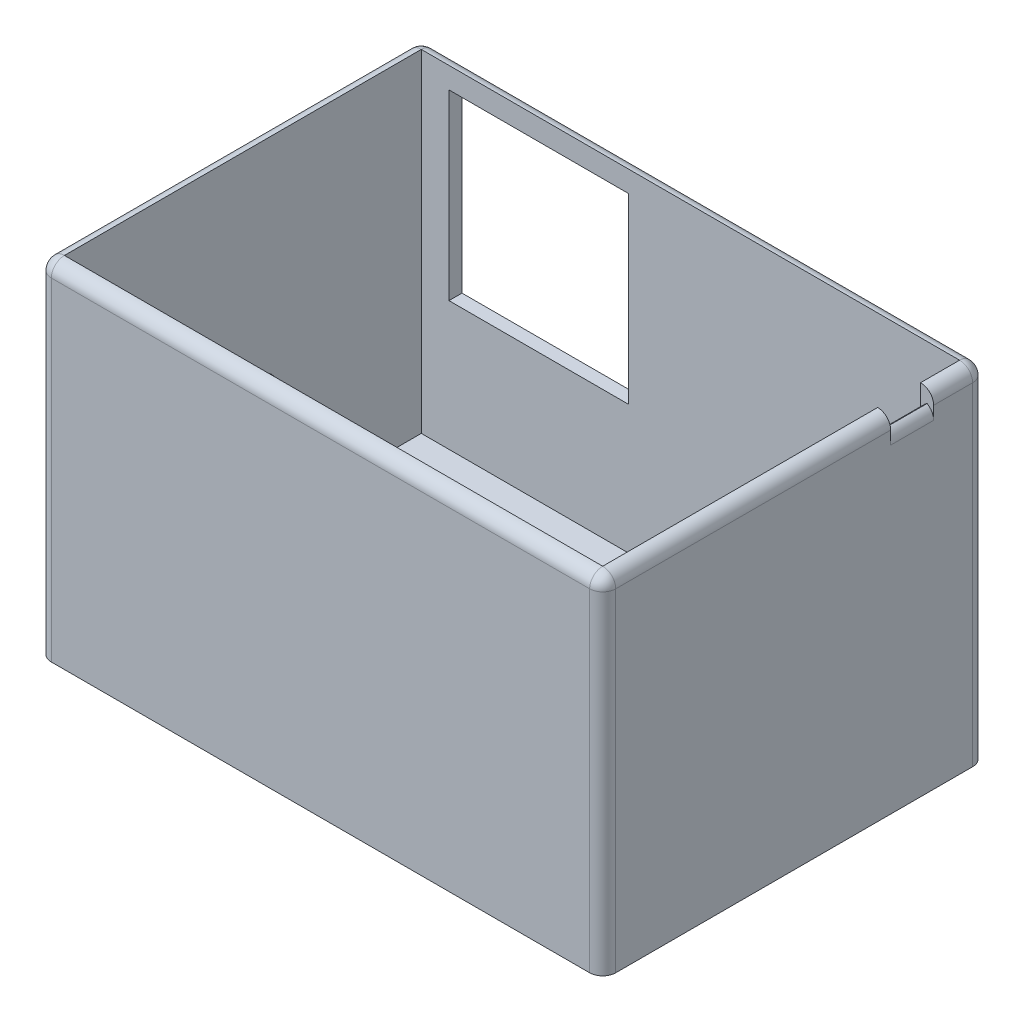
ISO-10303-21;
HEADER;
FILE_DESCRIPTION(('STEP AP214'),'2;1');
FILE_NAME('part.step','',(''),(''),'','','');
FILE_SCHEMA(('AUTOMOTIVE_DESIGN { 1 0 10303 214 1 1 1 1 }'));
ENDSEC;
DATA;
#1=APPLICATION_CONTEXT('core data for automotive mechanical design processes');
#2=APPLICATION_PROTOCOL_DEFINITION('international standard','automotive_design',2000,#1);
#3=PRODUCT_CONTEXT('',#1,'mechanical');
#4=PRODUCT('Part','Part','',(#3));
#5=PRODUCT_RELATED_PRODUCT_CATEGORY('part','',(#4));
#6=PRODUCT_DEFINITION_FORMATION('','',#4);
#7=PRODUCT_DEFINITION_CONTEXT('part definition',#1,'design');
#8=PRODUCT_DEFINITION('design','',#6,#7);
#9=PRODUCT_DEFINITION_SHAPE('','',#8);
#10=(LENGTH_UNIT() NAMED_UNIT(*) SI_UNIT(.MILLI.,.METRE.));
#11=(NAMED_UNIT(*) PLANE_ANGLE_UNIT() SI_UNIT($,.RADIAN.));
#12=(NAMED_UNIT(*) SI_UNIT($,.STERADIAN.) SOLID_ANGLE_UNIT());
#13=UNCERTAINTY_MEASURE_WITH_UNIT(LENGTH_MEASURE(1.E-05),#10,'distance_accuracy_value','');
#14=(GEOMETRIC_REPRESENTATION_CONTEXT(3) GLOBAL_UNCERTAINTY_ASSIGNED_CONTEXT((#13)) GLOBAL_UNIT_ASSIGNED_CONTEXT((#10,
#11,#12)) REPRESENTATION_CONTEXT('',''));
#15=CARTESIAN_POINT('',(0.,0.,0.));
#16=DIRECTION('',(0.,0.,1.));
#17=DIRECTION('',(1.,0.,0.));
#18=AXIS2_PLACEMENT_3D('',#15,#16,#17);
#19=CARTESIAN_POINT('',(41.275,51.,-29.365));
#20=DIRECTION('',(0.,0.,-1.));
#21=DIRECTION('',(-1.,0.,0.));
#22=AXIS2_PLACEMENT_3D('',#19,#20,#21);
#23=CYLINDRICAL_SURFACE('',#22,2.);
#24=CARTESIAN_POINT('',(41.275,51.,-14.7966567752096));
#25=DIRECTION('',(0.,0.,1.));
#26=DIRECTION('',(1.,0.,0.));
#27=AXIS2_PLACEMENT_3D('',#24,#25,#26);
#28=CIRCLE('',#27,2.);
#29=CARTESIAN_POINT('',(41.275,53.,-14.7966567752096));
#30=VERTEX_POINT('',#29);
#31=CARTESIAN_POINT('',(43.275,51.,-14.7966567752096));
#32=VERTEX_POINT('',#31);
#33=EDGE_CURVE('E470',#30,#32,#28,.F.);
#34=ORIENTED_EDGE('',*,*,#33,.F.);
#35=DIRECTION('',(0.,0.,1.));
#36=VECTOR('',#35,1.);
#37=CARTESIAN_POINT('',(41.275,53.,0.));
#38=LINE('',#37,#36);
#39=CARTESIAN_POINT('',(41.275,53.,27.365));
#40=VERTEX_POINT('',#39);
#41=EDGE_CURVE('E301',#30,#40,#38,.T.);
#42=ORIENTED_EDGE('',*,*,#41,.T.);
#43=CARTESIAN_POINT('',(41.275,51.,27.365));
#44=DIRECTION('',(0.,0.,1.));
#45=DIRECTION('',(0.,-1.,0.));
#46=AXIS2_PLACEMENT_3D('',#43,#44,#45);
#47=CIRCLE('',#46,2.);
#48=CARTESIAN_POINT('',(43.275,51.,27.365));
#49=VERTEX_POINT('',#48);
#50=EDGE_CURVE('E457',#49,#40,#47,.T.);
#51=ORIENTED_EDGE('',*,*,#50,.F.);
#52=DIRECTION('',(0.,0.,1.));
#53=VECTOR('',#52,1.);
#54=CARTESIAN_POINT('',(43.275,51.,29.365));
#55=LINE('',#54,#53);
#56=EDGE_CURVE('E394',#32,#49,#55,.T.);
#57=ORIENTED_EDGE('',*,*,#56,.F.);
#58=EDGE_LOOP('',(#34,#42,#51,#57));
#59=FACE_BOUND('',#58,.T.);
#60=ADVANCED_FACE('F46',(#59),#23,.T.);
#61=CARTESIAN_POINT('',(43.275,53.,-29.365));
#62=DIRECTION('',(1.,0.,0.));
#63=DIRECTION('',(0.,0.,-1.));
#64=AXIS2_PLACEMENT_3D('',#61,#62,#63);
#65=PLANE('',#64);
#66=CARTESIAN_POINT('',(43.275,51.,-27.365));
#67=VERTEX_POINT('',#66);
#68=CARTESIAN_POINT('',(43.275,51.,-21.3864446389071));
#69=VERTEX_POINT('',#68);
#70=EDGE_CURVE('E395',#67,#69,#55,.T.);
#71=ORIENTED_EDGE('',*,*,#70,.T.);
#72=DIRECTION('',(0.,-1.,0.));
#73=VECTOR('',#72,1.);
#74=CARTESIAN_POINT('',(43.275,51.,-21.3864446389071));
#75=LINE('',#74,#73);
#76=CARTESIAN_POINT('',(43.275,49.,-21.3864446389071));
#77=VERTEX_POINT('',#76);
#78=EDGE_CURVE('E481',#69,#77,#75,.T.);
#79=ORIENTED_EDGE('',*,*,#78,.T.);
#80=DIRECTION('',(0.,0.,-1.));
#81=VECTOR('',#80,1.);
#82=CARTESIAN_POINT('',(43.275,49.,-14.7966567752096));
#83=LINE('',#82,#81);
#84=CARTESIAN_POINT('',(43.275,49.,-14.7966567752096));
#85=VERTEX_POINT('',#84);
#86=EDGE_CURVE('E477',#77,#85,#83,.F.);
#87=ORIENTED_EDGE('',*,*,#86,.T.);
#88=DIRECTION('',(0.,1.,0.));
#89=VECTOR('',#88,1.);
#90=CARTESIAN_POINT('',(43.275,51.,-14.7966567752096));
#91=LINE('',#90,#89);
#92=EDGE_CURVE('E474',#85,#32,#91,.T.);
#93=ORIENTED_EDGE('',*,*,#92,.T.);
#94=ORIENTED_EDGE('',*,*,#56,.T.);
#95=DIRECTION('',(0.,-1.,0.));
#96=VECTOR('',#95,1.);
#97=CARTESIAN_POINT('',(43.275,53.,27.365));
#98=LINE('',#97,#96);
#99=CARTESIAN_POINT('',(43.275,0.,27.365));
#100=VERTEX_POINT('',#99);
#101=EDGE_CURVE('E399',#49,#100,#98,.T.);
#102=ORIENTED_EDGE('',*,*,#101,.T.);
#103=DIRECTION('',(0.,0.,1.));
#104=VECTOR('',#103,1.);
#105=CARTESIAN_POINT('',(43.275,0.,-29.365));
#106=LINE('',#105,#104);
#107=CARTESIAN_POINT('',(43.275,0.,-27.365));
#108=VERTEX_POINT('',#107);
#109=EDGE_CURVE('E291',#108,#100,#106,.T.);
#110=ORIENTED_EDGE('',*,*,#109,.F.);
#111=DIRECTION('',(0.,-1.,0.));
#112=VECTOR('',#111,1.);
#113=CARTESIAN_POINT('',(43.275,53.,-27.365));
#114=LINE('',#113,#112);
#115=EDGE_CURVE('E391',#108,#67,#114,.F.);
#116=ORIENTED_EDGE('',*,*,#115,.T.);
#117=EDGE_LOOP('',(#71,#79,#87,#93,#94,#102,#110,#116));
#118=FACE_BOUND('',#117,.T.);
#119=ADVANCED_FACE('F589',(#118),#65,.T.);
#120=CARTESIAN_POINT('',(43.275,53.,-29.365));
#121=DIRECTION('',(0.,0.,1.));
#122=DIRECTION('',(1.,0.,0.));
#123=AXIS2_PLACEMENT_3D('',#120,#121,#122);
#124=PLANE('',#123);
#125=DIRECTION('',(-1.,0.,0.));
#126=VECTOR('',#125,1.);
#127=CARTESIAN_POINT('',(-37.0331029560129,21.7540115767749,-29.365));
#128=LINE('',#127,#126);
#129=CARTESIAN_POINT('',(-9.53310295601291,21.7540115767749,-29.365));
#130=VERTEX_POINT('',#129);
#131=CARTESIAN_POINT('',(-37.0331029560129,21.7540115767749,-29.365));
#132=VERTEX_POINT('',#131);
#133=EDGE_CURVE('E250',#130,#132,#128,.T.);
#134=ORIENTED_EDGE('',*,*,#133,.F.);
#135=DIRECTION('',(0.,-1.,0.));
#136=VECTOR('',#135,1.);
#137=CARTESIAN_POINT('',(-9.5331029560129,49.7440115767749,-29.365));
#138=LINE('',#137,#136);
#139=CARTESIAN_POINT('',(-9.5331029560129,49.7440115767749,-29.365));
#140=VERTEX_POINT('',#139);
#141=EDGE_CURVE('E62',#140,#130,#138,.T.);
#142=ORIENTED_EDGE('',*,*,#141,.F.);
#143=DIRECTION('',(1.,0.,0.));
#144=VECTOR('',#143,1.);
#145=CARTESIAN_POINT('',(-37.0331029560129,49.7440115767749,-29.365));
#146=LINE('',#145,#144);
#147=CARTESIAN_POINT('',(-37.0331029560129,49.7440115767749,-29.365));
#148=VERTEX_POINT('',#147);
#149=EDGE_CURVE('E258',#148,#140,#146,.T.);
#150=ORIENTED_EDGE('',*,*,#149,.F.);
#151=DIRECTION('',(0.,1.,0.));
#152=VECTOR('',#151,1.);
#153=CARTESIAN_POINT('',(-37.0331029560129,49.7440115767749,-29.365));
#154=LINE('',#153,#152);
#155=EDGE_CURVE('E240',#132,#148,#154,.T.);
#156=ORIENTED_EDGE('',*,*,#155,.F.);
#157=EDGE_LOOP('',(#134,#142,#150,#156));
#158=FACE_BOUND('',#157,.T.);
#159=DIRECTION('',(-1.,0.,0.));
#160=VECTOR('',#159,1.);
#161=CARTESIAN_POINT('',(43.275,51.,-29.365));
#162=LINE('',#161,#160);
#163=CARTESIAN_POINT('',(-41.275,51.,-29.365));
#164=VERTEX_POINT('',#163);
#165=CARTESIAN_POINT('',(41.275,51.,-29.365));
#166=VERTEX_POINT('',#165);
#167=EDGE_CURVE('E385',#164,#166,#162,.F.);
#168=ORIENTED_EDGE('',*,*,#167,.T.);
#169=DIRECTION('',(0.,-1.,0.));
#170=VECTOR('',#169,1.);
#171=CARTESIAN_POINT('',(41.275,0.,-29.365));
#172=LINE('',#171,#170);
#173=CARTESIAN_POINT('',(41.275,0.,-29.365));
#174=VERTEX_POINT('',#173);
#175=EDGE_CURVE('E388',#166,#174,#172,.T.);
#176=ORIENTED_EDGE('',*,*,#175,.T.);
#177=DIRECTION('',(-1.,0.,0.));
#178=VECTOR('',#177,1.);
#179=CARTESIAN_POINT('',(43.275,0.,-29.365));
#180=LINE('',#179,#178);
#181=CARTESIAN_POINT('',(-41.275,0.,-29.365));
#182=VERTEX_POINT('',#181);
#183=EDGE_CURVE('E339',#174,#182,#180,.T.);
#184=ORIENTED_EDGE('',*,*,#183,.T.);
#185=DIRECTION('',(0.,-1.,0.));
#186=VECTOR('',#185,1.);
#187=CARTESIAN_POINT('',(-41.275,53.,-29.365));
#188=LINE('',#187,#186);
#189=EDGE_CURVE('E382',#182,#164,#188,.F.);
#190=ORIENTED_EDGE('',*,*,#189,.T.);
#191=EDGE_LOOP('',(#168,#176,#184,#190));
#192=FACE_BOUND('',#191,.T.);
#193=ADVANCED_FACE('F255',(#158,#192),#124,.F.);
#194=CARTESIAN_POINT('',(-43.275,53.,-29.365));
#195=DIRECTION('',(1.,0.,0.));
#196=DIRECTION('',(0.,0.,-1.));
#197=AXIS2_PLACEMENT_3D('',#194,#195,#196);
#198=PLANE('',#197);
#199=CARTESIAN_POINT('',(-43.275,13.8979250719779,3.00000000000001));
#200=DIRECTION('',(1.,0.,0.));
#201=DIRECTION('',(0.,0.,-1.));
#202=AXIS2_PLACEMENT_3D('',#199,#200,#201);
#203=CIRCLE('',#202,4.);
#204=CARTESIAN_POINT('',(-43.275,13.8979250719779,7.00000000000001));
#205=VERTEX_POINT('',#204);
#206=CARTESIAN_POINT('',(-43.275,9.89792507197792,3.00000000000001));
#207=VERTEX_POINT('',#206);
#208=EDGE_CURVE('E525',#205,#207,#203,.T.);
#209=ORIENTED_EDGE('',*,*,#208,.T.);
#210=DIRECTION('',(0.,0.,1.));
#211=VECTOR('',#210,1.);
#212=CARTESIAN_POINT('',(-43.275,9.89792507197791,-29.365));
#213=LINE('',#212,#211);
#214=CARTESIAN_POINT('',(-43.275,9.89792507197792,-2.99999999999999));
#215=VERTEX_POINT('',#214);
#216=EDGE_CURVE('E528',#207,#215,#213,.F.);
#217=ORIENTED_EDGE('',*,*,#216,.T.);
#218=CARTESIAN_POINT('',(-43.275,13.8979250719779,-2.99999999999999));
#219=DIRECTION('',(1.,0.,0.));
#220=DIRECTION('',(0.,0.,-1.));
#221=AXIS2_PLACEMENT_3D('',#218,#219,#220);
#222=CIRCLE('',#221,4.);
#223=CARTESIAN_POINT('',(-43.275,13.8979250719779,-6.99999999999999));
#224=VERTEX_POINT('',#223);
#225=EDGE_CURVE('E522',#215,#224,#222,.T.);
#226=ORIENTED_EDGE('',*,*,#225,.T.);
#227=DIRECTION('',(0.,-1.,0.));
#228=VECTOR('',#227,1.);
#229=CARTESIAN_POINT('',(-43.275,53.,-7.));
#230=LINE('',#229,#228);
#231=CARTESIAN_POINT('',(-43.275,19.8979250719779,-6.99999999999999));
#232=VERTEX_POINT('',#231);
#233=EDGE_CURVE('E516',#224,#232,#230,.F.);
#234=ORIENTED_EDGE('',*,*,#233,.T.);
#235=CARTESIAN_POINT('',(-43.275,19.8979250719779,-2.99999999999999));
#236=DIRECTION('',(1.,0.,0.));
#237=DIRECTION('',(0.,0.,-1.));
#238=AXIS2_PLACEMENT_3D('',#235,#236,#237);
#239=CIRCLE('',#238,4.);
#240=CARTESIAN_POINT('',(-43.275,23.8979250719779,-2.99999999999999));
#241=VERTEX_POINT('',#240);
#242=EDGE_CURVE('E509',#232,#241,#239,.T.);
#243=ORIENTED_EDGE('',*,*,#242,.T.);
#244=DIRECTION('',(0.,0.,-1.));
#245=VECTOR('',#244,1.);
#246=CARTESIAN_POINT('',(-43.275,23.8979250719779,-29.365));
#247=LINE('',#246,#245);
#248=CARTESIAN_POINT('',(-43.275,23.8979250719779,3.00000000000001));
#249=VERTEX_POINT('',#248);
#250=EDGE_CURVE('E502',#241,#249,#247,.F.);
#251=ORIENTED_EDGE('',*,*,#250,.T.);
#252=CARTESIAN_POINT('',(-43.275,19.8979250719779,3.00000000000001));
#253=DIRECTION('',(1.,0.,0.));
#254=DIRECTION('',(0.,0.,-1.));
#255=AXIS2_PLACEMENT_3D('',#252,#253,#254);
#256=CIRCLE('',#255,4.);
#257=CARTESIAN_POINT('',(-43.275,19.8979250719779,7.00000000000001));
#258=VERTEX_POINT('',#257);
#259=EDGE_CURVE('E512',#249,#258,#256,.T.);
#260=ORIENTED_EDGE('',*,*,#259,.T.);
#261=DIRECTION('',(0.,1.,0.));
#262=VECTOR('',#261,1.);
#263=CARTESIAN_POINT('',(-43.275,53.,7.00000000000001));
#264=LINE('',#263,#262);
#265=EDGE_CURVE('E519',#258,#205,#264,.F.);
#266=ORIENTED_EDGE('',*,*,#265,.T.);
#267=EDGE_LOOP('',(#209,#217,#226,#234,#243,#251,#260,#266));
#268=FACE_BOUND('',#267,.T.);
#269=DIRECTION('',(0.,0.,1.));
#270=VECTOR('',#269,1.);
#271=CARTESIAN_POINT('',(-43.275,0.,-29.365));
#272=LINE('',#271,#270);
#273=CARTESIAN_POINT('',(-43.275,0.,-27.365));
#274=VERTEX_POINT('',#273);
#275=CARTESIAN_POINT('',(-43.275,0.,27.365));
#276=VERTEX_POINT('',#275);
#277=EDGE_CURVE('E335',#274,#276,#272,.T.);
#278=ORIENTED_EDGE('',*,*,#277,.T.);
#279=DIRECTION('',(0.,-1.,0.));
#280=VECTOR('',#279,1.);
#281=CARTESIAN_POINT('',(-43.275,53.,27.365));
#282=LINE('',#281,#280);
#283=CARTESIAN_POINT('',(-43.275,51.,27.365));
#284=VERTEX_POINT('',#283);
#285=EDGE_CURVE('E379',#276,#284,#282,.F.);
#286=ORIENTED_EDGE('',*,*,#285,.T.);
#287=DIRECTION('',(0.,0.,1.));
#288=VECTOR('',#287,1.);
#289=CARTESIAN_POINT('',(-43.275,51.,-29.365));
#290=LINE('',#289,#288);
#291=CARTESIAN_POINT('',(-43.275,51.,-27.365));
#292=VERTEX_POINT('',#291);
#293=EDGE_CURVE('E375',#284,#292,#290,.F.);
#294=ORIENTED_EDGE('',*,*,#293,.T.);
#295=DIRECTION('',(0.,-1.,0.));
#296=VECTOR('',#295,1.);
#297=CARTESIAN_POINT('',(-43.275,53.,-27.365));
#298=LINE('',#297,#296);
#299=EDGE_CURVE('E372',#292,#274,#298,.T.);
#300=ORIENTED_EDGE('',*,*,#299,.T.);
#301=EDGE_LOOP('',(#278,#286,#294,#300));
#302=FACE_BOUND('',#301,.T.);
#303=ADVANCED_FACE('F668',(#268,#302),#198,.F.);
#304=CARTESIAN_POINT('',(43.275,53.,29.365));
#305=DIRECTION('',(0.,0.,1.));
#306=DIRECTION('',(1.,0.,0.));
#307=AXIS2_PLACEMENT_3D('',#304,#305,#306);
#308=PLANE('',#307);
#309=DIRECTION('',(-1.,0.,0.));
#310=VECTOR('',#309,1.);
#311=CARTESIAN_POINT('',(43.275,0.,29.365));
#312=LINE('',#311,#310);
#313=CARTESIAN_POINT('',(41.275,0.,29.365));
#314=VERTEX_POINT('',#313);
#315=CARTESIAN_POINT('',(-41.275,0.,29.365));
#316=VERTEX_POINT('',#315);
#317=EDGE_CURVE('E331',#314,#316,#312,.T.);
#318=ORIENTED_EDGE('',*,*,#317,.F.);
#319=DIRECTION('',(0.,-1.,0.));
#320=VECTOR('',#319,1.);
#321=CARTESIAN_POINT('',(41.275,53.,29.365));
#322=LINE('',#321,#320);
#323=CARTESIAN_POINT('',(41.275,51.,29.365));
#324=VERTEX_POINT('',#323);
#325=EDGE_CURVE('E408',#314,#324,#322,.F.);
#326=ORIENTED_EDGE('',*,*,#325,.T.);
#327=DIRECTION('',(-1.,0.,0.));
#328=VECTOR('',#327,1.);
#329=CARTESIAN_POINT('',(-43.275,51.,29.365));
#330=LINE('',#329,#328);
#331=CARTESIAN_POINT('',(-41.275,51.,29.365));
#332=VERTEX_POINT('',#331);
#333=EDGE_CURVE('E405',#324,#332,#330,.T.);
#334=ORIENTED_EDGE('',*,*,#333,.T.);
#335=DIRECTION('',(0.,-1.,0.));
#336=VECTOR('',#335,1.);
#337=CARTESIAN_POINT('',(-41.275,0.,29.365));
#338=LINE('',#337,#336);
#339=EDGE_CURVE('E402',#332,#316,#338,.T.);
#340=ORIENTED_EDGE('',*,*,#339,.T.);
#341=EDGE_LOOP('',(#318,#326,#334,#340));
#342=FACE_BOUND('',#341,.T.);
#343=ADVANCED_FACE('F656',(#342),#308,.T.);
#344=CARTESIAN_POINT('',(0.,0.,0.));
#345=DIRECTION('',(0.,-1.,0.));
#346=DIRECTION('',(0.,0.,-1.));
#347=AXIS2_PLACEMENT_3D('',#344,#345,#346);
#348=PLANE('',#347);
#349=ORIENTED_EDGE('',*,*,#109,.T.);
#350=CARTESIAN_POINT('',(41.275,0.,27.365));
#351=DIRECTION('',(0.,-1.,0.));
#352=DIRECTION('',(0.,0.,-1.));
#353=AXIS2_PLACEMENT_3D('',#350,#351,#352);
#354=CIRCLE('',#353,2.);
#355=EDGE_CURVE('E420',#100,#314,#354,.T.);
#356=ORIENTED_EDGE('',*,*,#355,.T.);
#357=ORIENTED_EDGE('',*,*,#317,.T.);
#358=CARTESIAN_POINT('',(-41.275,0.,27.365));
#359=DIRECTION('',(0.,-1.,0.));
#360=DIRECTION('',(0.,0.,-1.));
#361=AXIS2_PLACEMENT_3D('',#358,#359,#360);
#362=CIRCLE('',#361,2.);
#363=EDGE_CURVE('E414',#316,#276,#362,.T.);
#364=ORIENTED_EDGE('',*,*,#363,.T.);
#365=ORIENTED_EDGE('',*,*,#277,.F.);
#366=CARTESIAN_POINT('',(-41.275,0.,-27.365));
#367=DIRECTION('',(0.,-1.,0.));
#368=DIRECTION('',(0.,0.,-1.));
#369=AXIS2_PLACEMENT_3D('',#366,#367,#368);
#370=CIRCLE('',#369,2.);
#371=EDGE_CURVE('E411',#274,#182,#370,.T.);
#372=ORIENTED_EDGE('',*,*,#371,.T.);
#373=ORIENTED_EDGE('',*,*,#183,.F.);
#374=CARTESIAN_POINT('',(41.275,0.,-27.365));
#375=DIRECTION('',(0.,-1.,0.));
#376=DIRECTION('',(0.,0.,-1.));
#377=AXIS2_PLACEMENT_3D('',#374,#375,#376);
#378=CIRCLE('',#377,2.);
#379=EDGE_CURVE('E417',#174,#108,#378,.T.);
#380=ORIENTED_EDGE('',*,*,#379,.T.);
#381=EDGE_LOOP('',(#349,#356,#357,#364,#365,#372,#373,#380));
#382=FACE_BOUND('',#381,.T.);
#383=ADVANCED_FACE('F665',(#382),#348,.T.);
#384=CARTESIAN_POINT('',(41.275,53.,-29.365));
#385=DIRECTION('',(1.,0.,0.));
#386=DIRECTION('',(0.,0.,-1.));
#387=AXIS2_PLACEMENT_3D('',#384,#385,#386);
#388=PLANE('',#387);
#389=DIRECTION('',(0.,0.,-1.));
#390=VECTOR('',#389,1.);
#391=CARTESIAN_POINT('',(41.275,49.,-29.365));
#392=LINE('',#391,#390);
#393=CARTESIAN_POINT('',(41.275,49.,-14.7966567752096));
#394=VERTEX_POINT('',#393);
#395=CARTESIAN_POINT('',(41.275,49.,-21.3864446389071));
#396=VERTEX_POINT('',#395);
#397=EDGE_CURVE('E485',#394,#396,#392,.T.);
#398=ORIENTED_EDGE('',*,*,#397,.T.);
#399=DIRECTION('',(0.,1.,0.));
#400=VECTOR('',#399,1.);
#401=CARTESIAN_POINT('',(41.275,53.,-21.3864446389071));
#402=LINE('',#401,#400);
#403=CARTESIAN_POINT('',(41.275,53.,-21.3864446389071));
#404=VERTEX_POINT('',#403);
#405=EDGE_CURVE('E273',#396,#404,#402,.T.);
#406=ORIENTED_EDGE('',*,*,#405,.T.);
#407=CARTESIAN_POINT('',(41.275,53.,-27.365));
#408=VERTEX_POINT('',#407);
#409=EDGE_CURVE('E314',#408,#404,#38,.T.);
#410=ORIENTED_EDGE('',*,*,#409,.F.);
#411=DIRECTION('',(0.,-1.,0.));
#412=VECTOR('',#411,1.);
#413=CARTESIAN_POINT('',(41.275,53.,-27.365));
#414=LINE('',#413,#412);
#415=CARTESIAN_POINT('',(41.275,2.,-27.365));
#416=VERTEX_POINT('',#415);
#417=EDGE_CURVE('E288',#408,#416,#414,.T.);
#418=ORIENTED_EDGE('',*,*,#417,.T.);
#419=DIRECTION('',(0.,0.,1.));
#420=VECTOR('',#419,1.);
#421=CARTESIAN_POINT('',(41.275,2.,0.));
#422=LINE('',#421,#420);
#423=CARTESIAN_POINT('',(41.275,2.,27.365));
#424=VERTEX_POINT('',#423);
#425=EDGE_CURVE('E282',#416,#424,#422,.T.);
#426=ORIENTED_EDGE('',*,*,#425,.T.);
#427=DIRECTION('',(0.,-1.,0.));
#428=VECTOR('',#427,1.);
#429=CARTESIAN_POINT('',(41.275,53.,27.365));
#430=LINE('',#429,#428);
#431=EDGE_CURVE('E293',#40,#424,#430,.T.);
#432=ORIENTED_EDGE('',*,*,#431,.F.);
#433=ORIENTED_EDGE('',*,*,#41,.F.);
#434=DIRECTION('',(0.,-1.,0.));
#435=VECTOR('',#434,1.);
#436=CARTESIAN_POINT('',(41.275,53.,-14.7966567752096));
#437=LINE('',#436,#435);
#438=EDGE_CURVE('E277',#30,#394,#437,.T.);
#439=ORIENTED_EDGE('',*,*,#438,.T.);
#440=EDGE_LOOP('',(#398,#406,#410,#418,#426,#432,#433,#439));
#441=FACE_BOUND('',#440,.T.);
#442=ADVANCED_FACE('F622',(#441),#388,.F.);
#443=CARTESIAN_POINT('',(43.275,53.,-27.365));
#444=DIRECTION('',(0.,0.,1.));
#445=DIRECTION('',(1.,0.,0.));
#446=AXIS2_PLACEMENT_3D('',#443,#444,#445);
#447=PLANE('',#446);
#448=DIRECTION('',(0.,1.,0.));
#449=VECTOR('',#448,1.);
#450=CARTESIAN_POINT('',(-9.5331029560129,53.,-27.365));
#451=LINE('',#450,#449);
#452=CARTESIAN_POINT('',(-9.5331029560129,21.7540115767749,-27.365));
#453=VERTEX_POINT('',#452);
#454=CARTESIAN_POINT('',(-9.5331029560129,49.7440115767749,-27.365));
#455=VERTEX_POINT('',#454);
#456=EDGE_CURVE('E11',#453,#455,#451,.T.);
#457=ORIENTED_EDGE('',*,*,#456,.F.);
#458=DIRECTION('',(1.,0.,0.));
#459=VECTOR('',#458,1.);
#460=CARTESIAN_POINT('',(43.275,21.7540115767748,-27.365));
#461=LINE('',#460,#459);
#462=CARTESIAN_POINT('',(-37.0331029560129,21.7540115767749,-27.365));
#463=VERTEX_POINT('',#462);
#464=EDGE_CURVE('E531',#463,#453,#461,.T.);
#465=ORIENTED_EDGE('',*,*,#464,.F.);
#466=DIRECTION('',(0.,-1.,0.));
#467=VECTOR('',#466,1.);
#468=CARTESIAN_POINT('',(-37.0331029560129,53.0000000000001,-27.365));
#469=LINE('',#468,#467);
#470=CARTESIAN_POINT('',(-37.0331029560129,49.7440115767749,-27.365));
#471=VERTEX_POINT('',#470);
#472=EDGE_CURVE('E243',#471,#463,#469,.T.);
#473=ORIENTED_EDGE('',*,*,#472,.F.);
#474=DIRECTION('',(-1.,0.,0.));
#475=VECTOR('',#474,1.);
#476=CARTESIAN_POINT('',(43.275,49.7440115767749,-27.365));
#477=LINE('',#476,#475);
#478=EDGE_CURVE('E55',#455,#471,#477,.T.);
#479=ORIENTED_EDGE('',*,*,#478,.F.);
#480=EDGE_LOOP('',(#457,#465,#473,#479));
#481=FACE_BOUND('',#480,.T.);
#482=DIRECTION('',(-1.,0.,0.));
#483=VECTOR('',#482,1.);
#484=CARTESIAN_POINT('',(0.,2.,-27.365));
#485=LINE('',#484,#483);
#486=CARTESIAN_POINT('',(-41.275,2.,-27.365));
#487=VERTEX_POINT('',#486);
#488=EDGE_CURVE('E298',#416,#487,#485,.T.);
#489=ORIENTED_EDGE('',*,*,#488,.F.);
#490=ORIENTED_EDGE('',*,*,#417,.F.);
#491=DIRECTION('',(-1.,0.,0.));
#492=VECTOR('',#491,1.);
#493=CARTESIAN_POINT('',(0.,53.,-27.365));
#494=LINE('',#493,#492);
#495=CARTESIAN_POINT('',(-41.275,53.,-27.365));
#496=VERTEX_POINT('',#495);
#497=EDGE_CURVE('E297',#408,#496,#494,.T.);
#498=ORIENTED_EDGE('',*,*,#497,.T.);
#499=DIRECTION('',(0.,-1.,0.));
#500=VECTOR('',#499,1.);
#501=CARTESIAN_POINT('',(-41.275,53.,-27.365));
#502=LINE('',#501,#500);
#503=EDGE_CURVE('E292',#496,#487,#502,.T.);
#504=ORIENTED_EDGE('',*,*,#503,.T.);
#505=EDGE_LOOP('',(#489,#490,#498,#504));
#506=FACE_BOUND('',#505,.T.);
#507=ADVANCED_FACE('F570',(#481,#506),#447,.T.);
#508=CARTESIAN_POINT('',(-41.275,53.,-29.365));
#509=DIRECTION('',(1.,0.,0.));
#510=DIRECTION('',(0.,0.,-1.));
#511=AXIS2_PLACEMENT_3D('',#508,#509,#510);
#512=PLANE('',#511);
#513=DIRECTION('',(0.,1.,0.));
#514=VECTOR('',#513,1.);
#515=CARTESIAN_POINT('',(-41.275,53.,-4.99999999999999));
#516=LINE('',#515,#514);
#517=CARTESIAN_POINT('',(-41.275,13.8979250719779,-4.99999999999999));
#518=VERTEX_POINT('',#517);
#519=CARTESIAN_POINT('',(-41.275,19.8979250719779,-4.99999999999999));
#520=VERTEX_POINT('',#519);
#521=EDGE_CURVE('E355',#518,#520,#516,.T.);
#522=ORIENTED_EDGE('',*,*,#521,.F.);
#523=CARTESIAN_POINT('',(-41.275,13.8979250719779,-2.99999999999999));
#524=DIRECTION('',(1.,0.,0.));
#525=DIRECTION('',(0.,0.,-1.));
#526=AXIS2_PLACEMENT_3D('',#523,#524,#525);
#527=CIRCLE('',#526,2.);
#528=CARTESIAN_POINT('',(-41.275,11.8979250719779,-2.99999999999999));
#529=VERTEX_POINT('',#528);
#530=EDGE_CURVE('E362',#518,#529,#527,.F.);
#531=ORIENTED_EDGE('',*,*,#530,.T.);
#532=DIRECTION('',(0.,0.,-1.));
#533=VECTOR('',#532,1.);
#534=CARTESIAN_POINT('',(-41.275,11.8979250719779,-29.365));
#535=LINE('',#534,#533);
#536=CARTESIAN_POINT('',(-41.275,11.8979250719779,3.00000000000001));
#537=VERTEX_POINT('',#536);
#538=EDGE_CURVE('E343',#537,#529,#535,.T.);
#539=ORIENTED_EDGE('',*,*,#538,.F.);
#540=CARTESIAN_POINT('',(-41.275,13.8979250719779,3.00000000000001));
#541=DIRECTION('',(1.,0.,0.));
#542=DIRECTION('',(0.,0.,-1.));
#543=AXIS2_PLACEMENT_3D('',#540,#541,#542);
#544=CIRCLE('',#543,2.);
#545=CARTESIAN_POINT('',(-41.275,13.8979250719779,5.00000000000001));
#546=VERTEX_POINT('',#545);
#547=EDGE_CURVE('E359',#537,#546,#544,.F.);
#548=ORIENTED_EDGE('',*,*,#547,.T.);
#549=DIRECTION('',(0.,-1.,0.));
#550=VECTOR('',#549,1.);
#551=CARTESIAN_POINT('',(-41.275,53.,5.00000000000001));
#552=LINE('',#551,#550);
#553=CARTESIAN_POINT('',(-41.275,19.8979250719779,5.00000000000001));
#554=VERTEX_POINT('',#553);
#555=EDGE_CURVE('E347',#554,#546,#552,.T.);
#556=ORIENTED_EDGE('',*,*,#555,.F.);
#557=CARTESIAN_POINT('',(-41.275,19.8979250719779,3.00000000000001));
#558=DIRECTION('',(1.,0.,0.));
#559=DIRECTION('',(0.,0.,-1.));
#560=AXIS2_PLACEMENT_3D('',#557,#558,#559);
#561=CIRCLE('',#560,2.);
#562=CARTESIAN_POINT('',(-41.275,21.8979250719779,3.00000000000001));
#563=VERTEX_POINT('',#562);
#564=EDGE_CURVE('E365',#554,#563,#561,.F.);
#565=ORIENTED_EDGE('',*,*,#564,.T.);
#566=DIRECTION('',(0.,0.,1.));
#567=VECTOR('',#566,1.);
#568=CARTESIAN_POINT('',(-41.275,21.8979250719779,-29.365));
#569=LINE('',#568,#567);
#570=CARTESIAN_POINT('',(-41.275,21.8979250719779,-3.));
#571=VERTEX_POINT('',#570);
#572=EDGE_CURVE('E351',#571,#563,#569,.T.);
#573=ORIENTED_EDGE('',*,*,#572,.F.);
#574=CARTESIAN_POINT('',(-41.275,19.8979250719779,-2.99999999999999));
#575=DIRECTION('',(1.,0.,0.));
#576=DIRECTION('',(0.,0.,-1.));
#577=AXIS2_PLACEMENT_3D('',#574,#575,#576);
#578=CIRCLE('',#577,2.);
#579=EDGE_CURVE('E369',#571,#520,#578,.F.);
#580=ORIENTED_EDGE('',*,*,#579,.T.);
#581=EDGE_LOOP('',(#522,#531,#539,#548,#556,#565,#573,#580));
#582=FACE_BOUND('',#581,.T.);
#583=DIRECTION('',(0.,0.,1.));
#584=VECTOR('',#583,1.);
#585=CARTESIAN_POINT('',(-41.275,2.,0.));
#586=LINE('',#585,#584);
#587=CARTESIAN_POINT('',(-41.275,2.,27.365));
#588=VERTEX_POINT('',#587);
#589=EDGE_CURVE('E302',#487,#588,#586,.T.);
#590=ORIENTED_EDGE('',*,*,#589,.F.);
#591=ORIENTED_EDGE('',*,*,#503,.F.);
#592=DIRECTION('',(0.,0.,1.));
#593=VECTOR('',#592,1.);
#594=CARTESIAN_POINT('',(-41.275,53.,0.));
#595=LINE('',#594,#593);
#596=CARTESIAN_POINT('',(-41.275,53.,27.365));
#597=VERTEX_POINT('',#596);
#598=EDGE_CURVE('E321',#496,#597,#595,.T.);
#599=ORIENTED_EDGE('',*,*,#598,.T.);
#600=DIRECTION('',(0.,-1.,0.));
#601=VECTOR('',#600,1.);
#602=CARTESIAN_POINT('',(-41.275,53.,27.365));
#603=LINE('',#602,#601);
#604=EDGE_CURVE('E296',#597,#588,#603,.T.);
#605=ORIENTED_EDGE('',*,*,#604,.T.);
#606=EDGE_LOOP('',(#590,#591,#599,#605));
#607=FACE_BOUND('',#606,.T.);
#608=ADVANCED_FACE('F690',(#582,#607),#512,.T.);
#609=CARTESIAN_POINT('',(43.275,53.,27.365));
#610=DIRECTION('',(0.,0.,1.));
#611=DIRECTION('',(1.,0.,0.));
#612=AXIS2_PLACEMENT_3D('',#609,#610,#611);
#613=PLANE('',#612);
#614=DIRECTION('',(-1.,0.,0.));
#615=VECTOR('',#614,1.);
#616=CARTESIAN_POINT('',(0.,2.,27.365));
#617=LINE('',#616,#615);
#618=EDGE_CURVE('E286',#424,#588,#617,.T.);
#619=ORIENTED_EDGE('',*,*,#618,.T.);
#620=ORIENTED_EDGE('',*,*,#604,.F.);
#621=DIRECTION('',(-1.,0.,0.));
#622=VECTOR('',#621,1.);
#623=CARTESIAN_POINT('',(0.,53.,27.365));
#624=LINE('',#623,#622);
#625=EDGE_CURVE('E318',#40,#597,#624,.T.);
#626=ORIENTED_EDGE('',*,*,#625,.F.);
#627=ORIENTED_EDGE('',*,*,#431,.T.);
#628=EDGE_LOOP('',(#619,#620,#626,#627));
#629=FACE_BOUND('',#628,.T.);
#630=ADVANCED_FACE('F697',(#629),#613,.F.);
#631=CARTESIAN_POINT('',(0.,2.,0.));
#632=DIRECTION('',(0.,-1.,0.));
#633=DIRECTION('',(0.,0.,-1.));
#634=AXIS2_PLACEMENT_3D('',#631,#632,#633);
#635=PLANE('',#634);
#636=ORIENTED_EDGE('',*,*,#425,.F.);
#637=ORIENTED_EDGE('',*,*,#488,.T.);
#638=ORIENTED_EDGE('',*,*,#589,.T.);
#639=ORIENTED_EDGE('',*,*,#618,.F.);
#640=EDGE_LOOP('',(#636,#637,#638,#639));
#641=FACE_BOUND('',#640,.T.);
#642=ADVANCED_FACE('F612',(#641),#635,.F.);
#643=CARTESIAN_POINT('',(41.275,53.,-27.365));
#644=DIRECTION('',(0.,1.,0.));
#645=DIRECTION('',(0.,0.,1.));
#646=AXIS2_PLACEMENT_3D('',#643,#644,#645);
#647=CYLINDRICAL_SURFACE('',#646,2.);
#648=ORIENTED_EDGE('',*,*,#379,.F.);
#649=ORIENTED_EDGE('',*,*,#175,.F.);
#650=CARTESIAN_POINT('',(41.275,51.,-27.365));
#651=DIRECTION('',(0.,1.,0.));
#652=DIRECTION('',(0.,0.,1.));
#653=AXIS2_PLACEMENT_3D('',#650,#651,#652);
#654=CIRCLE('',#653,2.);
#655=EDGE_CURVE('E287',#67,#166,#654,.T.);
#656=ORIENTED_EDGE('',*,*,#655,.F.);
#657=ORIENTED_EDGE('',*,*,#115,.F.);
#658=EDGE_LOOP('',(#648,#649,#656,#657));
#659=FACE_BOUND('',#658,.T.);
#660=ADVANCED_FACE('F604',(#659),#647,.T.);
#661=CARTESIAN_POINT('',(41.275,51.,-21.3864446389071));
#662=DIRECTION('',(0.,0.,-1.));
#663=DIRECTION('',(-1.,0.,0.));
#664=AXIS2_PLACEMENT_3D('',#661,#662,#663);
#665=CIRCLE('',#664,2.);
#666=EDGE_CURVE('E423',#69,#404,#665,.F.);
#667=ORIENTED_EDGE('',*,*,#666,.F.);
#668=ORIENTED_EDGE('',*,*,#70,.F.);
#669=CARTESIAN_POINT('',(41.275,51.,-27.365));
#670=DIRECTION('',(0.,0.,-1.));
#671=DIRECTION('',(-1.,0.,0.));
#672=AXIS2_PLACEMENT_3D('',#669,#670,#671);
#673=CIRCLE('',#672,2.);
#674=EDGE_CURVE('E461',#408,#67,#673,.T.);
#675=ORIENTED_EDGE('',*,*,#674,.F.);
#676=ORIENTED_EDGE('',*,*,#409,.T.);
#677=EDGE_LOOP('',(#667,#668,#675,#676));
#678=FACE_BOUND('',#677,.T.);
#679=ADVANCED_FACE('F592',(#678),#23,.T.);
#680=CARTESIAN_POINT('',(41.275,53.,27.365));
#681=DIRECTION('',(0.,-1.,0.));
#682=DIRECTION('',(0.,0.,-1.));
#683=AXIS2_PLACEMENT_3D('',#680,#681,#682);
#684=CYLINDRICAL_SURFACE('',#683,2.);
#685=ORIENTED_EDGE('',*,*,#355,.F.);
#686=ORIENTED_EDGE('',*,*,#101,.F.);
#687=CARTESIAN_POINT('',(41.275,51.,27.365));
#688=DIRECTION('',(0.,1.,0.));
#689=DIRECTION('',(0.,0.,1.));
#690=AXIS2_PLACEMENT_3D('',#687,#688,#689);
#691=CIRCLE('',#690,2.);
#692=EDGE_CURVE('E453',#324,#49,#691,.T.);
#693=ORIENTED_EDGE('',*,*,#692,.F.);
#694=ORIENTED_EDGE('',*,*,#325,.F.);
#695=EDGE_LOOP('',(#685,#686,#693,#694));
#696=FACE_BOUND('',#695,.T.);
#697=ADVANCED_FACE('F603',(#696),#684,.T.);
#698=CARTESIAN_POINT('',(41.275,51.,-27.365));
#699=DIRECTION('',(1.,0.,0.));
#700=DIRECTION('',(0.,0.,-1.));
#701=AXIS2_PLACEMENT_3D('',#698,#699,#700);
#702=SPHERICAL_SURFACE('',#701,2.);
#703=ORIENTED_EDGE('',*,*,#674,.T.);
#704=ORIENTED_EDGE('',*,*,#655,.T.);
#705=CARTESIAN_POINT('',(41.275,51.,-27.365));
#706=DIRECTION('',(1.,0.,0.));
#707=DIRECTION('',(0.,0.,-1.));
#708=AXIS2_PLACEMENT_3D('',#705,#706,#707);
#709=CIRCLE('',#708,2.);
#710=EDGE_CURVE('E449',#408,#166,#709,.F.);
#711=ORIENTED_EDGE('',*,*,#710,.F.);
#712=EDGE_LOOP('',(#703,#704,#711));
#713=FACE_BOUND('',#712,.T.);
#714=ADVANCED_FACE('F609',(#713),#702,.T.);
#715=CARTESIAN_POINT('',(41.275,51.,27.365));
#716=DIRECTION('',(1.,0.,0.));
#717=DIRECTION('',(0.,0.,-1.));
#718=AXIS2_PLACEMENT_3D('',#715,#716,#717);
#719=SPHERICAL_SURFACE('',#718,2.);
#720=ORIENTED_EDGE('',*,*,#692,.T.);
#721=ORIENTED_EDGE('',*,*,#50,.T.);
#722=CARTESIAN_POINT('',(41.275,51.,27.365));
#723=DIRECTION('',(1.,0.,0.));
#724=DIRECTION('',(0.,0.,-1.));
#725=AXIS2_PLACEMENT_3D('',#722,#723,#724);
#726=CIRCLE('',#725,2.);
#727=EDGE_CURVE('E445',#324,#40,#726,.F.);
#728=ORIENTED_EDGE('',*,*,#727,.F.);
#729=EDGE_LOOP('',(#720,#721,#728));
#730=FACE_BOUND('',#729,.T.);
#731=ADVANCED_FACE('F648',(#730),#719,.T.);
#732=CARTESIAN_POINT('',(-41.275,53.,-27.365));
#733=DIRECTION('',(0.,-1.,0.));
#734=DIRECTION('',(0.,0.,-1.));
#735=AXIS2_PLACEMENT_3D('',#732,#733,#734);
#736=CYLINDRICAL_SURFACE('',#735,2.);
#737=ORIENTED_EDGE('',*,*,#371,.F.);
#738=ORIENTED_EDGE('',*,*,#299,.F.);
#739=CARTESIAN_POINT('',(-41.275,51.,-27.365));
#740=DIRECTION('',(0.,1.,0.));
#741=DIRECTION('',(0.,0.,1.));
#742=AXIS2_PLACEMENT_3D('',#739,#740,#741);
#743=CIRCLE('',#742,2.);
#744=EDGE_CURVE('E441',#164,#292,#743,.T.);
#745=ORIENTED_EDGE('',*,*,#744,.F.);
#746=ORIENTED_EDGE('',*,*,#189,.F.);
#747=EDGE_LOOP('',(#737,#738,#745,#746));
#748=FACE_BOUND('',#747,.T.);
#749=ADVANCED_FACE('F672',(#748),#736,.T.);
#750=CARTESIAN_POINT('',(0.,51.,-27.365));
#751=DIRECTION('',(-1.,0.,0.));
#752=DIRECTION('',(0.,0.,1.));
#753=AXIS2_PLACEMENT_3D('',#750,#751,#752);
#754=CYLINDRICAL_SURFACE('',#753,2.);
#755=ORIENTED_EDGE('',*,*,#710,.T.);
#756=ORIENTED_EDGE('',*,*,#167,.F.);
#757=CARTESIAN_POINT('',(-41.275,51.,-27.365));
#758=DIRECTION('',(-1.,0.,0.));
#759=DIRECTION('',(0.,0.,1.));
#760=AXIS2_PLACEMENT_3D('',#757,#758,#759);
#761=CIRCLE('',#760,2.);
#762=EDGE_CURVE('E437',#496,#164,#761,.T.);
#763=ORIENTED_EDGE('',*,*,#762,.F.);
#764=ORIENTED_EDGE('',*,*,#497,.F.);
#765=EDGE_LOOP('',(#755,#756,#763,#764));
#766=FACE_BOUND('',#765,.T.);
#767=ADVANCED_FACE('F683',(#766),#754,.T.);
#768=CARTESIAN_POINT('',(43.275,51.,27.365));
#769=DIRECTION('',(1.,0.,0.));
#770=DIRECTION('',(0.,0.,-1.));
#771=AXIS2_PLACEMENT_3D('',#768,#769,#770);
#772=CYLINDRICAL_SURFACE('',#771,2.);
#773=ORIENTED_EDGE('',*,*,#727,.T.);
#774=ORIENTED_EDGE('',*,*,#625,.T.);
#775=CARTESIAN_POINT('',(-41.275,51.,27.365));
#776=DIRECTION('',(-1.,0.,0.));
#777=DIRECTION('',(0.,-1.,0.));
#778=AXIS2_PLACEMENT_3D('',#775,#776,#777);
#779=CIRCLE('',#778,2.);
#780=EDGE_CURVE('E433',#332,#597,#779,.T.);
#781=ORIENTED_EDGE('',*,*,#780,.F.);
#782=ORIENTED_EDGE('',*,*,#333,.F.);
#783=EDGE_LOOP('',(#773,#774,#781,#782));
#784=FACE_BOUND('',#783,.T.);
#785=ADVANCED_FACE('F652',(#784),#772,.T.);
#786=CARTESIAN_POINT('',(-41.275,53.,27.365));
#787=DIRECTION('',(0.,1.,0.));
#788=DIRECTION('',(0.,0.,1.));
#789=AXIS2_PLACEMENT_3D('',#786,#787,#788);
#790=CYLINDRICAL_SURFACE('',#789,2.);
#791=ORIENTED_EDGE('',*,*,#363,.F.);
#792=ORIENTED_EDGE('',*,*,#339,.F.);
#793=CARTESIAN_POINT('',(-41.275,51.,27.365));
#794=DIRECTION('',(0.,1.,0.));
#795=DIRECTION('',(0.,0.,1.));
#796=AXIS2_PLACEMENT_3D('',#793,#794,#795);
#797=CIRCLE('',#796,2.);
#798=EDGE_CURVE('E429',#284,#332,#797,.T.);
#799=ORIENTED_EDGE('',*,*,#798,.F.);
#800=ORIENTED_EDGE('',*,*,#285,.F.);
#801=EDGE_LOOP('',(#791,#792,#799,#800));
#802=FACE_BOUND('',#801,.T.);
#803=ADVANCED_FACE('F660',(#802),#790,.T.);
#804=CARTESIAN_POINT('',(-41.275,51.,-27.365));
#805=DIRECTION('',(0.,0.,-1.));
#806=DIRECTION('',(-1.,0.,0.));
#807=AXIS2_PLACEMENT_3D('',#804,#805,#806);
#808=SPHERICAL_SURFACE('',#807,2.);
#809=ORIENTED_EDGE('',*,*,#762,.T.);
#810=ORIENTED_EDGE('',*,*,#744,.T.);
#811=CARTESIAN_POINT('',(-41.275,51.,-27.365));
#812=DIRECTION('',(0.,0.,-1.));
#813=DIRECTION('',(-1.,0.,0.));
#814=AXIS2_PLACEMENT_3D('',#811,#812,#813);
#815=CIRCLE('',#814,2.);
#816=EDGE_CURVE('E426',#496,#292,#815,.F.);
#817=ORIENTED_EDGE('',*,*,#816,.F.);
#818=EDGE_LOOP('',(#809,#810,#817));
#819=FACE_BOUND('',#818,.T.);
#820=ADVANCED_FACE('F726',(#819),#808,.T.);
#821=CARTESIAN_POINT('',(-41.275,51.,27.365));
#822=DIRECTION('',(0.,0.,1.));
#823=DIRECTION('',(1.,0.,0.));
#824=AXIS2_PLACEMENT_3D('',#821,#822,#823);
#825=SPHERICAL_SURFACE('',#824,2.);
#826=ORIENTED_EDGE('',*,*,#798,.T.);
#827=ORIENTED_EDGE('',*,*,#780,.T.);
#828=CARTESIAN_POINT('',(-41.275,51.,27.365));
#829=DIRECTION('',(0.,0.,1.));
#830=DIRECTION('',(1.,0.,0.));
#831=AXIS2_PLACEMENT_3D('',#828,#829,#830);
#832=CIRCLE('',#831,2.);
#833=EDGE_CURVE('E281',#284,#597,#832,.F.);
#834=ORIENTED_EDGE('',*,*,#833,.F.);
#835=EDGE_LOOP('',(#826,#827,#834));
#836=FACE_BOUND('',#835,.T.);
#837=ADVANCED_FACE('F722',(#836),#825,.T.);
#838=CARTESIAN_POINT('',(-41.275,51.,0.));
#839=DIRECTION('',(0.,0.,1.));
#840=DIRECTION('',(1.,0.,0.));
#841=AXIS2_PLACEMENT_3D('',#838,#839,#840);
#842=CYLINDRICAL_SURFACE('',#841,2.);
#843=ORIENTED_EDGE('',*,*,#816,.T.);
#844=ORIENTED_EDGE('',*,*,#293,.F.);
#845=ORIENTED_EDGE('',*,*,#833,.T.);
#846=ORIENTED_EDGE('',*,*,#598,.F.);
#847=EDGE_LOOP('',(#843,#844,#845,#846));
#848=FACE_BOUND('',#847,.T.);
#849=ADVANCED_FACE('F720',(#848),#842,.T.);
#850=CARTESIAN_POINT('',(29.275,51.,-14.7966567752096));
#851=DIRECTION('',(0.,0.,1.));
#852=DIRECTION('',(1.,0.,0.));
#853=AXIS2_PLACEMENT_3D('',#850,#851,#852);
#854=PLANE('',#853);
#855=ORIENTED_EDGE('',*,*,#33,.T.);
#856=ORIENTED_EDGE('',*,*,#92,.F.);
#857=CARTESIAN_POINT('',(41.275,49.,-14.7966567752096));
#858=DIRECTION('',(0.,0.,1.));
#859=DIRECTION('',(1.,0.,0.));
#860=AXIS2_PLACEMENT_3D('',#857,#858,#859);
#861=CIRCLE('',#860,2.);
#862=CARTESIAN_POINT('',(42.275,50.7320508075689,-14.7966567752096));
#863=VERTEX_POINT('',#862);
#864=EDGE_CURVE('E492',#85,#863,#861,.T.);
#865=ORIENTED_EDGE('',*,*,#864,.T.);
#866=CARTESIAN_POINT('',(43.275,49.,-14.7966567752096));
#867=DIRECTION('',(0.,0.,1.));
#868=DIRECTION('',(1.,0.,0.));
#869=AXIS2_PLACEMENT_3D('',#866,#867,#868);
#870=CIRCLE('',#869,2.);
#871=EDGE_CURVE('E498',#863,#394,#870,.T.);
#872=ORIENTED_EDGE('',*,*,#871,.T.);
#873=ORIENTED_EDGE('',*,*,#438,.F.);
#874=EDGE_LOOP('',(#855,#856,#865,#872,#873));
#875=FACE_BOUND('',#874,.T.);
#876=ADVANCED_FACE('F636',(#875),#854,.F.);
#877=CARTESIAN_POINT('',(29.275,51.,-21.3864446389071));
#878=DIRECTION('',(0.,0.,-1.));
#879=DIRECTION('',(-1.,0.,0.));
#880=AXIS2_PLACEMENT_3D('',#877,#878,#879);
#881=PLANE('',#880);
#882=ORIENTED_EDGE('',*,*,#405,.F.);
#883=CARTESIAN_POINT('',(43.275,49.,-21.3864446389071));
#884=DIRECTION('',(0.,0.,-1.));
#885=DIRECTION('',(-1.,0.,0.));
#886=AXIS2_PLACEMENT_3D('',#883,#884,#885);
#887=CIRCLE('',#886,2.);
#888=CARTESIAN_POINT('',(42.275,50.7320508075689,-21.3864446389071));
#889=VERTEX_POINT('',#888);
#890=EDGE_CURVE('E495',#396,#889,#887,.T.);
#891=ORIENTED_EDGE('',*,*,#890,.T.);
#892=CARTESIAN_POINT('',(41.275,49.,-21.3864446389071));
#893=DIRECTION('',(0.,0.,-1.));
#894=DIRECTION('',(-1.,0.,0.));
#895=AXIS2_PLACEMENT_3D('',#892,#893,#894);
#896=CIRCLE('',#895,2.);
#897=EDGE_CURVE('E489',#889,#77,#896,.T.);
#898=ORIENTED_EDGE('',*,*,#897,.T.);
#899=ORIENTED_EDGE('',*,*,#78,.F.);
#900=ORIENTED_EDGE('',*,*,#666,.T.);
#901=EDGE_LOOP('',(#882,#891,#898,#899,#900));
#902=FACE_BOUND('',#901,.T.);
#903=ADVANCED_FACE('F620',(#902),#881,.F.);
#904=CARTESIAN_POINT('',(43.275,49.,-29.365));
#905=DIRECTION('',(0.,0.,-1.));
#906=DIRECTION('',(-1.,0.,0.));
#907=AXIS2_PLACEMENT_3D('',#904,#905,#906);
#908=CYLINDRICAL_SURFACE('',#907,2.);
#909=ORIENTED_EDGE('',*,*,#397,.F.);
#910=ORIENTED_EDGE('',*,*,#871,.F.);
#911=DIRECTION('',(0.,0.,-1.));
#912=VECTOR('',#911,1.);
#913=CARTESIAN_POINT('',(42.275,50.7320508075689,-18.0915507070583));
#914=LINE('',#913,#912);
#915=EDGE_CURVE('E278',#889,#863,#914,.F.);
#916=ORIENTED_EDGE('',*,*,#915,.F.);
#917=ORIENTED_EDGE('',*,*,#890,.F.);
#918=EDGE_LOOP('',(#909,#910,#916,#917));
#919=FACE_BOUND('',#918,.T.);
#920=ADVANCED_FACE('F629',(#919),#908,.T.);
#921=CARTESIAN_POINT('',(41.275,49.,-14.7966567752096));
#922=DIRECTION('',(0.,0.,1.));
#923=DIRECTION('',(1.,0.,0.));
#924=AXIS2_PLACEMENT_3D('',#921,#922,#923);
#925=CYLINDRICAL_SURFACE('',#924,2.);
#926=ORIENTED_EDGE('',*,*,#864,.F.);
#927=ORIENTED_EDGE('',*,*,#86,.F.);
#928=ORIENTED_EDGE('',*,*,#897,.F.);
#929=ORIENTED_EDGE('',*,*,#915,.T.);
#930=EDGE_LOOP('',(#926,#927,#928,#929));
#931=FACE_BOUND('',#930,.T.);
#932=ADVANCED_FACE('F633',(#931),#925,.T.);
#933=CARTESIAN_POINT('',(-41.275,13.8979250719779,-2.99999999999999));
#934=DIRECTION('',(1.,0.,0.));
#935=DIRECTION('',(0.,0.,-1.));
#936=AXIS2_PLACEMENT_3D('',#933,#934,#935);
#937=TOROIDAL_SURFACE('',#936,4.,2.);
#938=CARTESIAN_POINT('',(-41.275,9.89792507197792,-2.99999999999999));
#939=DIRECTION('',(0.,0.,1.));
#940=DIRECTION('',(0.,-1.,0.));
#941=AXIS2_PLACEMENT_3D('',#938,#939,#940);
#942=CIRCLE('',#941,2.);
#943=EDGE_CURVE('E553',#529,#215,#942,.T.);
#944=ORIENTED_EDGE('',*,*,#943,.F.);
#945=ORIENTED_EDGE('',*,*,#530,.F.);
#946=CARTESIAN_POINT('',(-41.275,13.8979250719779,-6.99999999999999));
#947=DIRECTION('',(0.,1.,0.));
#948=DIRECTION('',(0.,0.,1.));
#949=AXIS2_PLACEMENT_3D('',#946,#947,#948);
#950=CIRCLE('',#949,2.);
#951=EDGE_CURVE('E506',#224,#518,#950,.T.);
#952=ORIENTED_EDGE('',*,*,#951,.F.);
#953=ORIENTED_EDGE('',*,*,#225,.F.);
#954=EDGE_LOOP('',(#944,#945,#952,#953));
#955=FACE_BOUND('',#954,.T.);
#956=ADVANCED_FACE('F48',(#955),#937,.T.);
#957=CARTESIAN_POINT('',(-41.275,21.8979250719779,-6.99999999999999));
#958=DIRECTION('',(0.,-1.,0.));
#959=DIRECTION('',(0.,0.,-1.));
#960=AXIS2_PLACEMENT_3D('',#957,#958,#959);
#961=CYLINDRICAL_SURFACE('',#960,2.);
#962=ORIENTED_EDGE('',*,*,#951,.T.);
#963=ORIENTED_EDGE('',*,*,#521,.T.);
#964=CARTESIAN_POINT('',(-41.275,19.8979250719779,-6.99999999999999));
#965=DIRECTION('',(0.,1.,0.));
#966=DIRECTION('',(0.,0.,1.));
#967=AXIS2_PLACEMENT_3D('',#964,#965,#966);
#968=CIRCLE('',#967,2.);
#969=EDGE_CURVE('E549',#232,#520,#968,.T.);
#970=ORIENTED_EDGE('',*,*,#969,.F.);
#971=ORIENTED_EDGE('',*,*,#233,.F.);
#972=EDGE_LOOP('',(#962,#963,#970,#971));
#973=FACE_BOUND('',#972,.T.);
#974=ADVANCED_FACE('F832',(#973),#961,.T.);
#975=CARTESIAN_POINT('',(-41.275,9.89792507197792,5.00000000000001));
#976=DIRECTION('',(0.,0.,1.));
#977=DIRECTION('',(1.,0.,0.));
#978=AXIS2_PLACEMENT_3D('',#975,#976,#977);
#979=CYLINDRICAL_SURFACE('',#978,2.);
#980=ORIENTED_EDGE('',*,*,#943,.T.);
#981=ORIENTED_EDGE('',*,*,#216,.F.);
#982=CARTESIAN_POINT('',(-41.275,9.89792507197792,3.00000000000001));
#983=DIRECTION('',(0.,0.,1.));
#984=DIRECTION('',(1.,0.,0.));
#985=AXIS2_PLACEMENT_3D('',#982,#983,#984);
#986=CIRCLE('',#985,2.);
#987=EDGE_CURVE('E545',#537,#207,#986,.T.);
#988=ORIENTED_EDGE('',*,*,#987,.F.);
#989=ORIENTED_EDGE('',*,*,#538,.T.);
#990=EDGE_LOOP('',(#980,#981,#988,#989));
#991=FACE_BOUND('',#990,.T.);
#992=ADVANCED_FACE('F842',(#991),#979,.T.);
#993=CARTESIAN_POINT('',(-41.275,19.8979250719779,-2.99999999999999));
#994=DIRECTION('',(1.,0.,0.));
#995=DIRECTION('',(0.,0.,-1.));
#996=AXIS2_PLACEMENT_3D('',#993,#994,#995);
#997=TOROIDAL_SURFACE('',#996,4.,2.);
#998=ORIENTED_EDGE('',*,*,#969,.T.);
#999=ORIENTED_EDGE('',*,*,#579,.F.);
#1000=CARTESIAN_POINT('',(-41.275,23.8979250719779,-2.99999999999999));
#1001=DIRECTION('',(0.,0.,1.));
#1002=DIRECTION('',(1.,0.,0.));
#1003=AXIS2_PLACEMENT_3D('',#1000,#1001,#1002);
#1004=CIRCLE('',#1003,2.);
#1005=EDGE_CURVE('E541',#241,#571,#1004,.T.);
#1006=ORIENTED_EDGE('',*,*,#1005,.F.);
#1007=ORIENTED_EDGE('',*,*,#242,.F.);
#1008=EDGE_LOOP('',(#998,#999,#1006,#1007));
#1009=FACE_BOUND('',#1008,.T.);
#1010=ADVANCED_FACE('F851',(#1009),#997,.T.);
#1011=CARTESIAN_POINT('',(-41.275,13.8979250719779,3.00000000000001));
#1012=DIRECTION('',(1.,0.,0.));
#1013=DIRECTION('',(0.,0.,-1.));
#1014=AXIS2_PLACEMENT_3D('',#1011,#1012,#1013);
#1015=TOROIDAL_SURFACE('',#1014,4.,2.);
#1016=ORIENTED_EDGE('',*,*,#987,.T.);
#1017=ORIENTED_EDGE('',*,*,#208,.F.);
#1018=CARTESIAN_POINT('',(-41.275,13.8979250719779,7.00000000000001));
#1019=DIRECTION('',(0.,1.,0.));
#1020=DIRECTION('',(0.,0.,1.));
#1021=AXIS2_PLACEMENT_3D('',#1018,#1019,#1020);
#1022=CIRCLE('',#1021,2.);
#1023=EDGE_CURVE('E537',#546,#205,#1022,.T.);
#1024=ORIENTED_EDGE('',*,*,#1023,.F.);
#1025=ORIENTED_EDGE('',*,*,#547,.F.);
#1026=EDGE_LOOP('',(#1016,#1017,#1024,#1025));
#1027=FACE_BOUND('',#1026,.T.);
#1028=ADVANCED_FACE('F861',(#1027),#1015,.T.);
#1029=CARTESIAN_POINT('',(-41.275,23.8979250719779,5.00000000000001));
#1030=DIRECTION('',(0.,0.,-1.));
#1031=DIRECTION('',(-1.,0.,0.));
#1032=AXIS2_PLACEMENT_3D('',#1029,#1030,#1031);
#1033=CYLINDRICAL_SURFACE('',#1032,2.);
#1034=ORIENTED_EDGE('',*,*,#1005,.T.);
#1035=ORIENTED_EDGE('',*,*,#572,.T.);
#1036=CARTESIAN_POINT('',(-41.275,23.8979250719779,3.00000000000001));
#1037=DIRECTION('',(0.,0.,1.));
#1038=DIRECTION('',(1.,0.,0.));
#1039=AXIS2_PLACEMENT_3D('',#1036,#1037,#1038);
#1040=CIRCLE('',#1039,2.);
#1041=EDGE_CURVE('E534',#249,#563,#1040,.T.);
#1042=ORIENTED_EDGE('',*,*,#1041,.F.);
#1043=ORIENTED_EDGE('',*,*,#250,.F.);
#1044=EDGE_LOOP('',(#1034,#1035,#1042,#1043));
#1045=FACE_BOUND('',#1044,.T.);
#1046=ADVANCED_FACE('F872',(#1045),#1033,.T.);
#1047=CARTESIAN_POINT('',(-41.275,21.8979250719779,7.00000000000001));
#1048=DIRECTION('',(0.,1.,0.));
#1049=DIRECTION('',(0.,0.,1.));
#1050=AXIS2_PLACEMENT_3D('',#1047,#1048,#1049);
#1051=CYLINDRICAL_SURFACE('',#1050,2.);
#1052=ORIENTED_EDGE('',*,*,#1023,.T.);
#1053=ORIENTED_EDGE('',*,*,#265,.F.);
#1054=CARTESIAN_POINT('',(-41.275,19.8979250719779,7.00000000000001));
#1055=DIRECTION('',(0.,1.,0.));
#1056=DIRECTION('',(0.,0.,1.));
#1057=AXIS2_PLACEMENT_3D('',#1054,#1055,#1056);
#1058=CIRCLE('',#1057,2.);
#1059=EDGE_CURVE('E268',#554,#258,#1058,.T.);
#1060=ORIENTED_EDGE('',*,*,#1059,.F.);
#1061=ORIENTED_EDGE('',*,*,#555,.T.);
#1062=EDGE_LOOP('',(#1052,#1053,#1060,#1061));
#1063=FACE_BOUND('',#1062,.T.);
#1064=ADVANCED_FACE('F583',(#1063),#1051,.T.);
#1065=CARTESIAN_POINT('',(-41.275,19.8979250719779,3.00000000000001));
#1066=DIRECTION('',(1.,0.,0.));
#1067=DIRECTION('',(0.,0.,-1.));
#1068=AXIS2_PLACEMENT_3D('',#1065,#1066,#1067);
#1069=TOROIDAL_SURFACE('',#1068,4.,2.);
#1070=ORIENTED_EDGE('',*,*,#1041,.T.);
#1071=ORIENTED_EDGE('',*,*,#564,.F.);
#1072=ORIENTED_EDGE('',*,*,#1059,.T.);
#1073=ORIENTED_EDGE('',*,*,#259,.F.);
#1074=EDGE_LOOP('',(#1070,#1071,#1072,#1073));
#1075=FACE_BOUND('',#1074,.T.);
#1076=ADVANCED_FACE('F575',(#1075),#1069,.T.);
#1077=CARTESIAN_POINT('',(-9.5331029560129,49.7440115767749,-19.365));
#1078=DIRECTION('',(1.,0.,0.));
#1079=DIRECTION('',(0.,0.,-1.));
#1080=AXIS2_PLACEMENT_3D('',#1077,#1078,#1079);
#1081=PLANE('',#1080);
#1082=ORIENTED_EDGE('',*,*,#456,.T.);
#1083=DIRECTION('',(0.,0.,-1.));
#1084=VECTOR('',#1083,1.);
#1085=CARTESIAN_POINT('',(-9.5331029560129,49.7440115767749,-19.365));
#1086=LINE('',#1085,#1084);
#1087=EDGE_CURVE('E265',#455,#140,#1086,.T.);
#1088=ORIENTED_EDGE('',*,*,#1087,.T.);
#1089=ORIENTED_EDGE('',*,*,#141,.T.);
#1090=DIRECTION('',(0.,0.,-1.));
#1091=VECTOR('',#1090,1.);
#1092=CARTESIAN_POINT('',(-9.5331029560129,21.7540115767749,-19.365));
#1093=LINE('',#1092,#1091);
#1094=EDGE_CURVE('E247',#453,#130,#1093,.T.);
#1095=ORIENTED_EDGE('',*,*,#1094,.F.);
#1096=EDGE_LOOP('',(#1082,#1088,#1089,#1095));
#1097=FACE_BOUND('',#1096,.T.);
#1098=ADVANCED_FACE('F572',(#1097),#1081,.F.);
#1099=CARTESIAN_POINT('',(-37.0331029560129,49.7440115767749,-19.365));
#1100=DIRECTION('',(0.,1.,0.));
#1101=DIRECTION('',(0.,0.,1.));
#1102=AXIS2_PLACEMENT_3D('',#1099,#1100,#1101);
#1103=PLANE('',#1102);
#1104=ORIENTED_EDGE('',*,*,#478,.T.);
#1105=DIRECTION('',(0.,0.,-1.));
#1106=VECTOR('',#1105,1.);
#1107=CARTESIAN_POINT('',(-37.0331029560129,49.7440115767749,-19.365));
#1108=LINE('',#1107,#1106);
#1109=EDGE_CURVE('E246',#471,#148,#1108,.T.);
#1110=ORIENTED_EDGE('',*,*,#1109,.T.);
#1111=ORIENTED_EDGE('',*,*,#149,.T.);
#1112=ORIENTED_EDGE('',*,*,#1087,.F.);
#1113=EDGE_LOOP('',(#1104,#1110,#1111,#1112));
#1114=FACE_BOUND('',#1113,.T.);
#1115=ADVANCED_FACE('F567',(#1114),#1103,.F.);
#1116=CARTESIAN_POINT('',(-37.0331029560129,49.7440115767749,-19.365));
#1117=DIRECTION('',(-1.,0.,0.));
#1118=DIRECTION('',(0.,-1.,0.));
#1119=AXIS2_PLACEMENT_3D('',#1116,#1117,#1118);
#1120=PLANE('',#1119);
#1121=ORIENTED_EDGE('',*,*,#472,.T.);
#1122=DIRECTION('',(0.,0.,-1.));
#1123=VECTOR('',#1122,1.);
#1124=CARTESIAN_POINT('',(-37.0331029560129,21.7540115767749,-19.365));
#1125=LINE('',#1124,#1123);
#1126=EDGE_CURVE('E70',#463,#132,#1125,.T.);
#1127=ORIENTED_EDGE('',*,*,#1126,.T.);
#1128=ORIENTED_EDGE('',*,*,#155,.T.);
#1129=ORIENTED_EDGE('',*,*,#1109,.F.);
#1130=EDGE_LOOP('',(#1121,#1127,#1128,#1129));
#1131=FACE_BOUND('',#1130,.T.);
#1132=ADVANCED_FACE('F237',(#1131),#1120,.F.);
#1133=CARTESIAN_POINT('',(-37.0331029560129,21.7540115767749,-19.365));
#1134=DIRECTION('',(0.,-1.,0.));
#1135=DIRECTION('',(1.,0.,0.));
#1136=AXIS2_PLACEMENT_3D('',#1133,#1134,#1135);
#1137=PLANE('',#1136);
#1138=ORIENTED_EDGE('',*,*,#464,.T.);
#1139=ORIENTED_EDGE('',*,*,#1094,.T.);
#1140=ORIENTED_EDGE('',*,*,#133,.T.);
#1141=ORIENTED_EDGE('',*,*,#1126,.F.);
#1142=EDGE_LOOP('',(#1138,#1139,#1140,#1141));
#1143=FACE_BOUND('',#1142,.T.);
#1144=ADVANCED_FACE('F251',(#1143),#1137,.F.);
#1145=CLOSED_SHELL('',(#60,#119,#193,#303,#343,#383,#442,#507,#608,#630,#642,#660,#679,#697,
#714,#731,#749,#767,#785,#803,#820,#837,#849,#876,#903,#920,#932,#956,#974,#992,#1010,#1028,
#1046,#1064,#1076,#1098,#1115,#1132,#1144));
#1146=MANIFOLD_SOLID_BREP('B2',#1145);
#1147=ADVANCED_BREP_SHAPE_REPRESENTATION('',(#18,#1146),#14);
#1148=SHAPE_DEFINITION_REPRESENTATION(#9,#1147);
ENDSEC;
END-ISO-10303-21;
